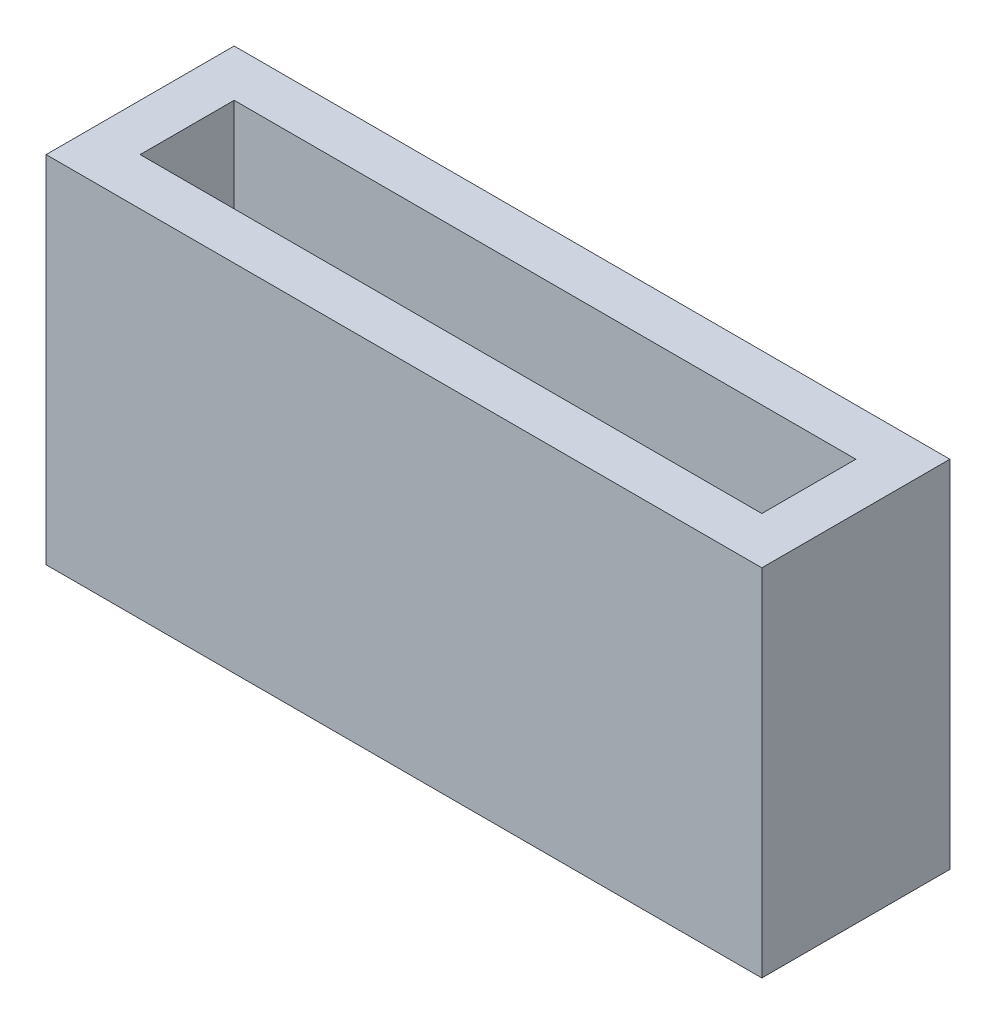
ISO-10303-21;
HEADER;
FILE_DESCRIPTION(('STEP AP214'),'2;1');
FILE_NAME('part.step','',(''),(''),'','','');
FILE_SCHEMA(('AUTOMOTIVE_DESIGN { 1 0 10303 214 1 1 1 1 }'));
ENDSEC;
DATA;
#1=APPLICATION_CONTEXT('core data for automotive mechanical design processes');
#2=APPLICATION_PROTOCOL_DEFINITION('international standard','automotive_design',2000,#1);
#3=PRODUCT_CONTEXT('',#1,'mechanical');
#4=PRODUCT('Part','Part','',(#3));
#5=PRODUCT_RELATED_PRODUCT_CATEGORY('part','',(#4));
#6=PRODUCT_DEFINITION_FORMATION('','',#4);
#7=PRODUCT_DEFINITION_CONTEXT('part definition',#1,'design');
#8=PRODUCT_DEFINITION('design','',#6,#7);
#9=PRODUCT_DEFINITION_SHAPE('','',#8);
#10=(LENGTH_UNIT() NAMED_UNIT(*) SI_UNIT(.MILLI.,.METRE.));
#11=(NAMED_UNIT(*) PLANE_ANGLE_UNIT() SI_UNIT($,.RADIAN.));
#12=(NAMED_UNIT(*) SI_UNIT($,.STERADIAN.) SOLID_ANGLE_UNIT());
#13=UNCERTAINTY_MEASURE_WITH_UNIT(LENGTH_MEASURE(1.E-05),#10,'distance_accuracy_value','');
#14=(GEOMETRIC_REPRESENTATION_CONTEXT(3) GLOBAL_UNCERTAINTY_ASSIGNED_CONTEXT((#13)) GLOBAL_UNIT_ASSIGNED_CONTEXT((#10,
#11,#12)) REPRESENTATION_CONTEXT('',''));
#15=CARTESIAN_POINT('',(0.,0.,0.));
#16=DIRECTION('',(0.,0.,1.));
#17=DIRECTION('',(1.,0.,0.));
#18=AXIS2_PLACEMENT_3D('',#15,#16,#17);
#19=CARTESIAN_POINT('',(-55.1703041057928,17.,19.7187884386319));
#20=DIRECTION('',(1.,0.,0.));
#21=DIRECTION('',(0.,0.,-1.));
#22=AXIS2_PLACEMENT_3D('',#19,#20,#21);
#23=PLANE('',#22);
#24=DIRECTION('',(0.,0.,1.));
#25=VECTOR('',#24,1.);
#26=CARTESIAN_POINT('',(-55.1703041057928,0.,19.7187884386319));
#27=LINE('',#26,#25);
#28=CARTESIAN_POINT('',(-55.1703041057928,0.,19.7187884386319));
#29=VERTEX_POINT('',#28);
#30=CARTESIAN_POINT('',(-55.1703041057928,0.,28.7187884386319));
#31=VERTEX_POINT('',#30);
#32=EDGE_CURVE('E158',#29,#31,#27,.T.);
#33=ORIENTED_EDGE('',*,*,#32,.T.);
#34=DIRECTION('',(0.,-1.,0.));
#35=VECTOR('',#34,1.);
#36=CARTESIAN_POINT('',(-55.1703041057928,17.,28.7187884386319));
#37=LINE('',#36,#35);
#38=CARTESIAN_POINT('',(-55.1703041057928,17.,28.7187884386319));
#39=VERTEX_POINT('',#38);
#40=EDGE_CURVE('E11',#39,#31,#37,.T.);
#41=ORIENTED_EDGE('',*,*,#40,.F.);
#42=DIRECTION('',(0.,0.,1.));
#43=VECTOR('',#42,1.);
#44=CARTESIAN_POINT('',(-55.1703041057928,17.,19.7187884386319));
#45=LINE('',#44,#43);
#46=CARTESIAN_POINT('',(-55.1703041057928,17.,19.7187884386319));
#47=VERTEX_POINT('',#46);
#48=EDGE_CURVE('E164',#47,#39,#45,.T.);
#49=ORIENTED_EDGE('',*,*,#48,.F.);
#50=DIRECTION('',(0.,-1.,0.));
#51=VECTOR('',#50,1.);
#52=CARTESIAN_POINT('',(-55.1703041057928,17.,19.7187884386319));
#53=LINE('',#52,#51);
#54=EDGE_CURVE('E174',#47,#29,#53,.T.);
#55=ORIENTED_EDGE('',*,*,#54,.T.);
#56=EDGE_LOOP('',(#33,#41,#49,#55));
#57=FACE_BOUND('',#56,.T.);
#58=ADVANCED_FACE('F39',(#57),#23,.F.);
#59=CARTESIAN_POINT('',(-55.1703041057928,17.,28.7187884386319));
#60=DIRECTION('',(0.,0.,-1.));
#61=DIRECTION('',(-1.,0.,0.));
#62=AXIS2_PLACEMENT_3D('',#59,#60,#61);
#63=PLANE('',#62);
#64=DIRECTION('',(1.,0.,0.));
#65=VECTOR('',#64,1.);
#66=CARTESIAN_POINT('',(-55.1703041057928,0.,28.7187884386319));
#67=LINE('',#66,#65);
#68=CARTESIAN_POINT('',(-20.9203041057928,0.,28.7187884386319));
#69=VERTEX_POINT('',#68);
#70=EDGE_CURVE('E178',#31,#69,#67,.T.);
#71=ORIENTED_EDGE('',*,*,#70,.T.);
#72=DIRECTION('',(0.,-1.,0.));
#73=VECTOR('',#72,1.);
#74=CARTESIAN_POINT('',(-20.9203041057928,17.,28.7187884386319));
#75=LINE('',#74,#73);
#76=CARTESIAN_POINT('',(-20.9203041057928,17.,28.7187884386319));
#77=VERTEX_POINT('',#76);
#78=EDGE_CURVE('E47',#77,#69,#75,.T.);
#79=ORIENTED_EDGE('',*,*,#78,.F.);
#80=DIRECTION('',(1.,0.,0.));
#81=VECTOR('',#80,1.);
#82=CARTESIAN_POINT('',(-55.1703041057928,17.,28.7187884386319));
#83=LINE('',#82,#81);
#84=EDGE_CURVE('E91',#39,#77,#83,.T.);
#85=ORIENTED_EDGE('',*,*,#84,.F.);
#86=ORIENTED_EDGE('',*,*,#40,.T.);
#87=EDGE_LOOP('',(#71,#79,#85,#86));
#88=FACE_BOUND('',#87,.T.);
#89=ADVANCED_FACE('F213',(#88),#63,.F.);
#90=CARTESIAN_POINT('',(-20.9203041057928,17.,19.7187884386319));
#91=DIRECTION('',(-1.,0.,0.));
#92=DIRECTION('',(0.,0.,1.));
#93=AXIS2_PLACEMENT_3D('',#90,#91,#92);
#94=PLANE('',#93);
#95=DIRECTION('',(0.,0.,-1.));
#96=VECTOR('',#95,1.);
#97=CARTESIAN_POINT('',(-20.9203041057928,0.,19.7187884386319));
#98=LINE('',#97,#96);
#99=CARTESIAN_POINT('',(-20.9203041057928,0.,19.7187884386319));
#100=VERTEX_POINT('',#99);
#101=EDGE_CURVE('E181',#69,#100,#98,.T.);
#102=ORIENTED_EDGE('',*,*,#101,.T.);
#103=DIRECTION('',(0.,-1.,0.));
#104=VECTOR('',#103,1.);
#105=CARTESIAN_POINT('',(-20.9203041057928,17.,19.7187884386319));
#106=LINE('',#105,#104);
#107=CARTESIAN_POINT('',(-20.9203041057928,17.,19.7187884386319));
#108=VERTEX_POINT('',#107);
#109=EDGE_CURVE('E188',#108,#100,#106,.T.);
#110=ORIENTED_EDGE('',*,*,#109,.F.);
#111=DIRECTION('',(0.,0.,-1.));
#112=VECTOR('',#111,1.);
#113=CARTESIAN_POINT('',(-20.9203041057928,17.,19.7187884386319));
#114=LINE('',#113,#112);
#115=EDGE_CURVE('E169',#77,#108,#114,.T.);
#116=ORIENTED_EDGE('',*,*,#115,.F.);
#117=ORIENTED_EDGE('',*,*,#78,.T.);
#118=EDGE_LOOP('',(#102,#110,#116,#117));
#119=FACE_BOUND('',#118,.T.);
#120=ADVANCED_FACE('F195',(#119),#94,.F.);
#121=CARTESIAN_POINT('',(-55.1703041057928,17.,19.7187884386319));
#122=DIRECTION('',(0.,0.,1.));
#123=DIRECTION('',(1.,0.,0.));
#124=AXIS2_PLACEMENT_3D('',#121,#122,#123);
#125=PLANE('',#124);
#126=DIRECTION('',(-1.,0.,0.));
#127=VECTOR('',#126,1.);
#128=CARTESIAN_POINT('',(-55.1703041057928,0.,19.7187884386319));
#129=LINE('',#128,#127);
#130=EDGE_CURVE('E84',#100,#29,#129,.T.);
#131=ORIENTED_EDGE('',*,*,#130,.T.);
#132=ORIENTED_EDGE('',*,*,#54,.F.);
#133=DIRECTION('',(-1.,0.,0.));
#134=VECTOR('',#133,1.);
#135=CARTESIAN_POINT('',(-55.1703041057928,17.,19.7187884386319));
#136=LINE('',#135,#134);
#137=EDGE_CURVE('E63',#108,#47,#136,.T.);
#138=ORIENTED_EDGE('',*,*,#137,.F.);
#139=ORIENTED_EDGE('',*,*,#109,.T.);
#140=EDGE_LOOP('',(#131,#132,#138,#139));
#141=FACE_BOUND('',#140,.T.);
#142=ADVANCED_FACE('F203',(#141),#125,.F.);
#143=CARTESIAN_POINT('',(0.,17.,0.));
#144=DIRECTION('',(0.,1.,0.));
#145=DIRECTION('',(0.,0.,1.));
#146=AXIS2_PLACEMENT_3D('',#143,#144,#145);
#147=PLANE('',#146);
#148=DIRECTION('',(-1.,0.,0.));
#149=VECTOR('',#148,1.);
#150=CARTESIAN_POINT('',(-23.1703041057928,17.,21.9687884386319));
#151=LINE('',#150,#149);
#152=CARTESIAN_POINT('',(-23.1703041057928,17.,21.9687884386319));
#153=VERTEX_POINT('',#152);
#154=CARTESIAN_POINT('',(-52.9203041057928,17.,21.9687884386319));
#155=VERTEX_POINT('',#154);
#156=EDGE_CURVE('E54',#153,#155,#151,.T.);
#157=ORIENTED_EDGE('',*,*,#156,.F.);
#158=DIRECTION('',(0.,0.,-1.));
#159=VECTOR('',#158,1.);
#160=CARTESIAN_POINT('',(-23.1703041057928,17.,26.4687884386319));
#161=LINE('',#160,#159);
#162=CARTESIAN_POINT('',(-23.1703041057928,17.,26.4687884386319));
#163=VERTEX_POINT('',#162);
#164=EDGE_CURVE('E136',#163,#153,#161,.T.);
#165=ORIENTED_EDGE('',*,*,#164,.F.);
#166=DIRECTION('',(1.,0.,0.));
#167=VECTOR('',#166,1.);
#168=CARTESIAN_POINT('',(-52.9203041057928,17.,26.4687884386319));
#169=LINE('',#168,#167);
#170=CARTESIAN_POINT('',(-52.9203041057928,17.,26.4687884386319));
#171=VERTEX_POINT('',#170);
#172=EDGE_CURVE('E140',#171,#163,#169,.T.);
#173=ORIENTED_EDGE('',*,*,#172,.F.);
#174=DIRECTION('',(0.,0.,1.));
#175=VECTOR('',#174,1.);
#176=CARTESIAN_POINT('',(-52.9203041057928,17.,21.9687884386319));
#177=LINE('',#176,#175);
#178=EDGE_CURVE('E149',#155,#171,#177,.T.);
#179=ORIENTED_EDGE('',*,*,#178,.F.);
#180=EDGE_LOOP('',(#157,#165,#173,#179));
#181=FACE_BOUND('',#180,.T.);
#182=ORIENTED_EDGE('',*,*,#48,.T.);
#183=ORIENTED_EDGE('',*,*,#84,.T.);
#184=ORIENTED_EDGE('',*,*,#115,.T.);
#185=ORIENTED_EDGE('',*,*,#137,.T.);
#186=EDGE_LOOP('',(#182,#183,#184,#185));
#187=FACE_BOUND('',#186,.T.);
#188=ADVANCED_FACE('F205',(#181,#187),#147,.T.);
#189=CARTESIAN_POINT('',(0.,0.,0.));
#190=DIRECTION('',(0.,1.,0.));
#191=DIRECTION('',(0.,0.,1.));
#192=AXIS2_PLACEMENT_3D('',#189,#190,#191);
#193=PLANE('',#192);
#194=ORIENTED_EDGE('',*,*,#32,.F.);
#195=ORIENTED_EDGE('',*,*,#130,.F.);
#196=ORIENTED_EDGE('',*,*,#101,.F.);
#197=ORIENTED_EDGE('',*,*,#70,.F.);
#198=EDGE_LOOP('',(#194,#195,#196,#197));
#199=FACE_BOUND('',#198,.T.);
#200=ADVANCED_FACE('F199',(#199),#193,.F.);
#201=CARTESIAN_POINT('',(-23.1703041057928,2.,21.9687884386319));
#202=DIRECTION('',(0.,0.,-1.));
#203=DIRECTION('',(-1.,0.,0.));
#204=AXIS2_PLACEMENT_3D('',#201,#202,#203);
#205=PLANE('',#204);
#206=ORIENTED_EDGE('',*,*,#156,.T.);
#207=DIRECTION('',(0.,1.,0.));
#208=VECTOR('',#207,1.);
#209=CARTESIAN_POINT('',(-52.9203041057928,2.,21.9687884386319));
#210=LINE('',#209,#208);
#211=CARTESIAN_POINT('',(-52.9203041057928,2.,21.9687884386319));
#212=VERTEX_POINT('',#211);
#213=EDGE_CURVE('E111',#212,#155,#210,.T.);
#214=ORIENTED_EDGE('',*,*,#213,.F.);
#215=DIRECTION('',(-1.,0.,0.));
#216=VECTOR('',#215,1.);
#217=CARTESIAN_POINT('',(-23.1703041057928,2.,21.9687884386319));
#218=LINE('',#217,#216);
#219=CARTESIAN_POINT('',(-23.1703041057928,2.,21.9687884386319));
#220=VERTEX_POINT('',#219);
#221=EDGE_CURVE('E115',#220,#212,#218,.T.);
#222=ORIENTED_EDGE('',*,*,#221,.F.);
#223=DIRECTION('',(0.,1.,0.));
#224=VECTOR('',#223,1.);
#225=CARTESIAN_POINT('',(-23.1703041057928,2.,21.9687884386319));
#226=LINE('',#225,#224);
#227=EDGE_CURVE('E155',#220,#153,#226,.T.);
#228=ORIENTED_EDGE('',*,*,#227,.T.);
#229=EDGE_LOOP('',(#206,#214,#222,#228));
#230=FACE_BOUND('',#229,.T.);
#231=ADVANCED_FACE('F113',(#230),#205,.F.);
#232=CARTESIAN_POINT('',(-23.1703041057928,2.,26.4687884386319));
#233=DIRECTION('',(1.,0.,0.));
#234=DIRECTION('',(0.,0.,-1.));
#235=AXIS2_PLACEMENT_3D('',#232,#233,#234);
#236=PLANE('',#235);
#237=ORIENTED_EDGE('',*,*,#164,.T.);
#238=ORIENTED_EDGE('',*,*,#227,.F.);
#239=DIRECTION('',(0.,0.,-1.));
#240=VECTOR('',#239,1.);
#241=CARTESIAN_POINT('',(-23.1703041057928,2.,26.4687884386319));
#242=LINE('',#241,#240);
#243=CARTESIAN_POINT('',(-23.1703041057928,2.,26.4687884386319));
#244=VERTEX_POINT('',#243);
#245=EDGE_CURVE('E122',#244,#220,#242,.T.);
#246=ORIENTED_EDGE('',*,*,#245,.F.);
#247=DIRECTION('',(0.,1.,0.));
#248=VECTOR('',#247,1.);
#249=CARTESIAN_POINT('',(-23.1703041057928,2.,26.4687884386319));
#250=LINE('',#249,#248);
#251=EDGE_CURVE('E159',#244,#163,#250,.T.);
#252=ORIENTED_EDGE('',*,*,#251,.T.);
#253=EDGE_LOOP('',(#237,#238,#246,#252));
#254=FACE_BOUND('',#253,.T.);
#255=ADVANCED_FACE('F252',(#254),#236,.F.);
#256=CARTESIAN_POINT('',(-52.9203041057928,2.,26.4687884386319));
#257=DIRECTION('',(0.,0.,1.));
#258=DIRECTION('',(1.,0.,0.));
#259=AXIS2_PLACEMENT_3D('',#256,#257,#258);
#260=PLANE('',#259);
#261=ORIENTED_EDGE('',*,*,#172,.T.);
#262=ORIENTED_EDGE('',*,*,#251,.F.);
#263=DIRECTION('',(1.,0.,0.));
#264=VECTOR('',#263,1.);
#265=CARTESIAN_POINT('',(-52.9203041057928,2.,26.4687884386319));
#266=LINE('',#265,#264);
#267=CARTESIAN_POINT('',(-52.9203041057928,2.,26.4687884386319));
#268=VERTEX_POINT('',#267);
#269=EDGE_CURVE('E131',#268,#244,#266,.T.);
#270=ORIENTED_EDGE('',*,*,#269,.F.);
#271=DIRECTION('',(0.,1.,0.));
#272=VECTOR('',#271,1.);
#273=CARTESIAN_POINT('',(-52.9203041057928,2.,26.4687884386319));
#274=LINE('',#273,#272);
#275=EDGE_CURVE('E121',#268,#171,#274,.T.);
#276=ORIENTED_EDGE('',*,*,#275,.T.);
#277=EDGE_LOOP('',(#261,#262,#270,#276));
#278=FACE_BOUND('',#277,.T.);
#279=ADVANCED_FACE('F261',(#278),#260,.F.);
#280=CARTESIAN_POINT('',(-52.9203041057928,2.,21.9687884386319));
#281=DIRECTION('',(-1.,0.,0.));
#282=DIRECTION('',(0.,0.,1.));
#283=AXIS2_PLACEMENT_3D('',#280,#281,#282);
#284=PLANE('',#283);
#285=ORIENTED_EDGE('',*,*,#178,.T.);
#286=ORIENTED_EDGE('',*,*,#275,.F.);
#287=DIRECTION('',(0.,0.,1.));
#288=VECTOR('',#287,1.);
#289=CARTESIAN_POINT('',(-52.9203041057928,2.,21.9687884386319));
#290=LINE('',#289,#288);
#291=EDGE_CURVE('E125',#212,#268,#290,.T.);
#292=ORIENTED_EDGE('',*,*,#291,.F.);
#293=ORIENTED_EDGE('',*,*,#213,.T.);
#294=EDGE_LOOP('',(#285,#286,#292,#293));
#295=FACE_BOUND('',#294,.T.);
#296=ADVANCED_FACE('F126',(#295),#284,.F.);
#297=CARTESIAN_POINT('',(0.,2.,0.));
#298=DIRECTION('',(0.,1.,0.));
#299=DIRECTION('',(0.,0.,1.));
#300=AXIS2_PLACEMENT_3D('',#297,#298,#299);
#301=PLANE('',#300);
#302=ORIENTED_EDGE('',*,*,#221,.T.);
#303=ORIENTED_EDGE('',*,*,#291,.T.);
#304=ORIENTED_EDGE('',*,*,#269,.T.);
#305=ORIENTED_EDGE('',*,*,#245,.T.);
#306=EDGE_LOOP('',(#302,#303,#304,#305));
#307=FACE_BOUND('',#306,.T.);
#308=ADVANCED_FACE('F133',(#307),#301,.T.);
#309=CLOSED_SHELL('',(#58,#89,#120,#142,#188,#200,#231,#255,#279,#296,#308));
#310=MANIFOLD_SOLID_BREP('B2',#309);
#311=ADVANCED_BREP_SHAPE_REPRESENTATION('',(#18,#310),#14);
#312=SHAPE_DEFINITION_REPRESENTATION(#9,#311);
ENDSEC;
END-ISO-10303-21;
